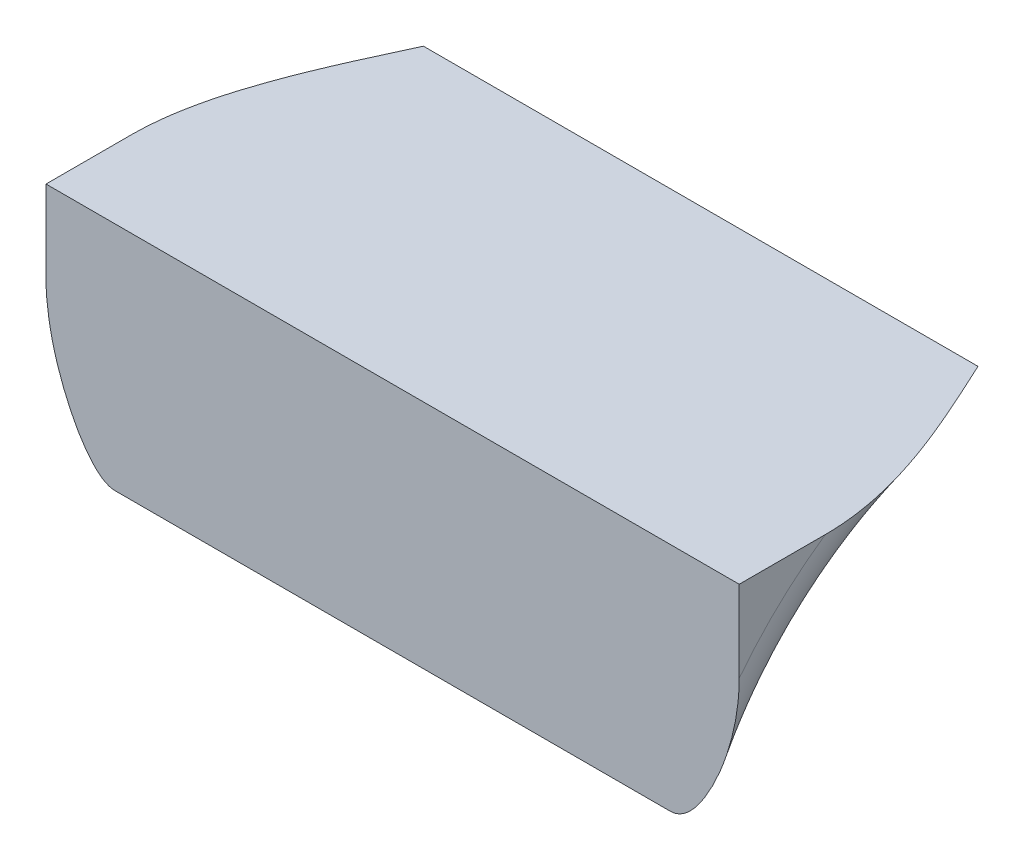
ISO-10303-21;
HEADER;
FILE_DESCRIPTION(('STEP AP214'),'2;1');
FILE_NAME('part.step','',(''),(''),'','','');
FILE_SCHEMA(('AUTOMOTIVE_DESIGN { 1 0 10303 214 1 1 1 1 }'));
ENDSEC;
DATA;
#1=APPLICATION_CONTEXT('core data for automotive mechanical design processes');
#2=APPLICATION_PROTOCOL_DEFINITION('international standard','automotive_design',2000,#1);
#3=PRODUCT_CONTEXT('',#1,'mechanical');
#4=PRODUCT('Part','Part','',(#3));
#5=PRODUCT_RELATED_PRODUCT_CATEGORY('part','',(#4));
#6=PRODUCT_DEFINITION_FORMATION('','',#4);
#7=PRODUCT_DEFINITION_CONTEXT('part definition',#1,'design');
#8=PRODUCT_DEFINITION('design','',#6,#7);
#9=PRODUCT_DEFINITION_SHAPE('','',#8);
#10=(LENGTH_UNIT() NAMED_UNIT(*) SI_UNIT(.MILLI.,.METRE.));
#11=(NAMED_UNIT(*) PLANE_ANGLE_UNIT() SI_UNIT($,.RADIAN.));
#12=(NAMED_UNIT(*) SI_UNIT($,.STERADIAN.) SOLID_ANGLE_UNIT());
#13=UNCERTAINTY_MEASURE_WITH_UNIT(LENGTH_MEASURE(1.E-05),#10,'distance_accuracy_value','');
#14=(GEOMETRIC_REPRESENTATION_CONTEXT(3) GLOBAL_UNCERTAINTY_ASSIGNED_CONTEXT((#13)) GLOBAL_UNIT_ASSIGNED_CONTEXT((#10,
#11,#12)) REPRESENTATION_CONTEXT('',''));
#15=CARTESIAN_POINT('',(0.,0.,0.));
#16=DIRECTION('',(0.,0.,1.));
#17=DIRECTION('',(1.,0.,0.));
#18=AXIS2_PLACEMENT_3D('',#15,#16,#17);
#19=CARTESIAN_POINT('',(5.34,-0.0166666666666927,-7.4));
#20=DIRECTION('',(-1.,0.,0.));
#21=DIRECTION('',(0.,0.,1.));
#22=AXIS2_PLACEMENT_3D('',#19,#20,#21);
#23=TOROIDAL_SURFACE('',#22,0.506666666666995,0.0899999999999993);
#24=CARTESIAN_POINT('',(5.34,-0.0166666666667221,-7.40000000000002));
#25=DIRECTION('',(-1.,0.,0.));
#26=DIRECTION('',(0.,0.,1.));
#27=AXIS2_PLACEMENT_3D('',#24,#25,#26);
#28=CIRCLE('',#27,0.416666666667021);
#29=CARTESIAN_POINT('',(5.34,0.10000000000003,-6.99999999999984));
#30=VERTEX_POINT('',#29);
#31=CARTESIAN_POINT('',(5.34,0.40000000000015,-7.4));
#32=VERTEX_POINT('',#31);
#33=EDGE_CURVE('E73',#30,#32,#28,.T.);
#34=ORIENTED_EDGE('',*,*,#33,.F.);
#35=CARTESIAN_POINT('',(5.25,0.29431743439214,-7.));
#36=CARTESIAN_POINT('',(5.25000257689525,0.28678338106452,-7.));
#37=CARTESIAN_POINT('',(5.25035567443866,0.279258916889631,-7.));
#38=CARTESIAN_POINT('',(5.25168700961234,0.264272874659193,-7.));
#39=CARTESIAN_POINT('',(5.25266455596784,0.256811236297325,-7.));
#40=CARTESIAN_POINT('',(5.25645142527365,0.234384133764241,-7.));
#41=CARTESIAN_POINT('',(5.26011148185746,0.219557655967787,-7.));
#42=CARTESIAN_POINT('',(5.26872439377415,0.19245860087185,-7.));
#43=CARTESIAN_POINT('',(5.27344165067632,0.180107956902744,-7.));
#44=CARTESIAN_POINT('',(5.28429411076941,0.156106187281331,-7.));
#45=CARTESIAN_POINT('',(5.29042016907056,0.144451135807996,-7.));
#46=CARTESIAN_POINT('',(5.30139175619852,0.127808975217373,-7.));
#47=CARTESIAN_POINT('',(5.30542956548305,0.122317350027401,-7.));
#48=CARTESIAN_POINT('',(5.31226356939469,0.114702664993153,-7.));
#49=CARTESIAN_POINT('',(5.31468981703352,0.112254142604962,-7.));
#50=CARTESIAN_POINT('',(5.31989362601097,0.107759627038366,-7.));
#51=CARTESIAN_POINT('',(5.32266929637702,0.105711608382615,-7.));
#52=CARTESIAN_POINT('',(5.32711460086318,0.103229870103113,-7.));
#53=CARTESIAN_POINT('',(5.32862028994545,0.102507233993482,-7.));
#54=CARTESIAN_POINT('',(5.33172418480276,0.101308280914606,-7.));
#55=CARTESIAN_POINT('',(5.33332199935786,0.100830996992606,-7.));
#56=CARTESIAN_POINT('',(5.33577880463312,0.100339629092012,-7.));
#57=CARTESIAN_POINT('',(5.33661601690168,0.100213173945489,-7.));
#58=CARTESIAN_POINT('',(5.3383019081971,0.100042972537691,-7.));
#59=CARTESIAN_POINT('',(5.33915061835458,0.099999536662611,-7.));
#60=CARTESIAN_POINT('',(5.34000000000035,0.100000000002899,-7.));
#61=B_SPLINE_CURVE_WITH_KNOTS('',3,(#35,#36,#37,#38,#39,#40,#41,#42,#43,#44,#45,#46,#47,#48,#49,
#50,#51,#52,#53,#54,#55,#56,#57,#58,#59,#60),.UNSPECIFIED.,.F.,.F.,(4,2,2,2,2,2,2,2,2,2,2,2,4),
(0.,0.0225788096461363,0.0451326674055985,0.0907782215687072,0.130374817366258,
0.169721295314198,0.19008827818017,0.200409303674087,0.210676699975487,0.215671790378637,
0.220647040822455,0.22318341517181,0.225729253917657),.UNSPECIFIED.);
#62=CARTESIAN_POINT('',(5.25,0.294317434392195,-7.));
#63=VERTEX_POINT('',#62);
#64=EDGE_CURVE('E68',#63,#30,#61,.T.);
#65=ORIENTED_EDGE('',*,*,#64,.F.);
#66=CARTESIAN_POINT('',(5.25,-0.0166666666666927,-7.4));
#67=DIRECTION('',(-1.,0.,0.));
#68=DIRECTION('',(0.,0.,1.));
#69=AXIS2_PLACEMENT_3D('',#66,#67,#68);
#70=CIRCLE('',#69,0.506666666666991);
#71=CARTESIAN_POINT('',(5.25,0.4,-7.11172929389074));
#72=VERTEX_POINT('',#71);
#73=EDGE_CURVE('E21',#72,#63,#70,.F.);
#74=ORIENTED_EDGE('',*,*,#73,.F.);
#75=CARTESIAN_POINT('',(5.34,0.400000000000152,-7.4));
#76=CARTESIAN_POINT('',(5.3394264635353,0.400000000000097,-7.39876593194068));
#77=CARTESIAN_POINT('',(5.33885292373588,0.400000000000047,-7.39753187207807));
#78=CARTESIAN_POINT('',(5.32561245318219,0.399999999998967,-7.36903846077597));
#79=CARTESIAN_POINT('',(5.31298285975115,0.399999999999728,-7.34176487111438));
#80=CARTESIAN_POINT('',(5.2895306975533,0.400000000000272,-7.28639982309714));
#81=CARTESIAN_POINT('',(5.27870698290532,0.400000000000054,-7.25830889675784));
#82=CARTESIAN_POINT('',(5.26489408361845,0.399999999999969,-7.21303952048627));
#83=CARTESIAN_POINT('',(5.26052997024305,0.399999999999992,-7.19629446422212));
#84=CARTESIAN_POINT('',(5.25378981108278,0.400000000000008,-7.16238876865434));
#85=CARTESIAN_POINT('',(5.25141174148565,0.400000000000002,-7.14522857078599));
#86=CARTESIAN_POINT('',(5.2498281432553,0.399999999999999,-7.11659396280128));
#87=CARTESIAN_POINT('',(5.24981959727615,0.4,-7.10516725656242));
#88=CARTESIAN_POINT('',(5.25139009883906,0.4,-7.0824144027815));
#89=CARTESIAN_POINT('',(5.25296658349862,0.4,-7.07108812268302));
#90=CARTESIAN_POINT('',(5.25725870229677,0.4,-7.05266875179284));
#91=CARTESIAN_POINT('',(5.25940558470931,0.4,-7.0454444396699));
#92=CARTESIAN_POINT('',(5.26473137562286,0.4,-7.03138042185793));
#93=CARTESIAN_POINT('',(5.26790890880121,0.4,-7.02454021779805));
#94=CARTESIAN_POINT('',(5.27443884956401,0.4,-7.01326965039486));
#95=CARTESIAN_POINT('',(5.27751935045147,0.4,-7.00868262471168));
#96=CARTESIAN_POINT('',(5.28436041779118,0.4,-7.00004403667216));
#97=CARTESIAN_POINT('',(5.28811998896204,0.4,-6.99599170548487));
#98=CARTESIAN_POINT('',(5.29543188886495,0.4,-6.98944200302973));
#99=CARTESIAN_POINT('',(5.29885228428787,0.4,-6.9867980071836));
#100=CARTESIAN_POINT('',(5.30608102890694,0.4,-6.98210160120376));
#101=CARTESIAN_POINT('',(5.3098891862173,0.4,-6.98004890037208));
#102=CARTESIAN_POINT('',(5.31785061443701,0.4,-6.97665091304317));
#103=CARTESIAN_POINT('',(5.32200646589342,0.4,-6.97531158287709));
#104=CARTESIAN_POINT('',(5.33050109227432,0.4,-6.9734751714876));
#105=CARTESIAN_POINT('',(5.33483973726038,0.4,-6.97297750198901));
#106=CARTESIAN_POINT('',(5.34294181761328,0.4,-6.97287406118691));
#107=CARTESIAN_POINT('',(5.34670423222505,0.4,-6.97315746171378));
#108=CARTESIAN_POINT('',(5.35412119918076,0.4,-6.97436584450932));
#109=CARTESIAN_POINT('',(5.35777582473137,0.4,-6.97529038036805));
#110=CARTESIAN_POINT('',(5.36481422020849,0.4,-6.97769876130399));
#111=CARTESIAN_POINT('',(5.36820185844863,0.4,-6.97917145764801));
#112=CARTESIAN_POINT('',(5.37472828980895,0.4,-6.98260485602442));
#113=CARTESIAN_POINT('',(5.37786642500256,0.4,-6.98456679532048));
#114=CARTESIAN_POINT('',(5.38507271381958,0.4,-6.9897808110808));
#115=CARTESIAN_POINT('',(5.38899555576081,0.4,-6.99323221615451));
#116=CARTESIAN_POINT('',(5.39620981145504,0.4,-7.00070636123279));
#117=CARTESIAN_POINT('',(5.39950481977874,0.4,-7.00472560425642));
#118=CARTESIAN_POINT('',(5.40248619789847,0.4,-7.00893530556599));
#119=B_SPLINE_CURVE_WITH_KNOTS('',3,(#75,#76,#77,#78,#79,#80,#81,#82,#83,#84,#85,#86,#87,#88,
#89,#90,#91,#92,#93,#94,#95,#96,#97,#98,#99,#100,#101,#102,#103,#104,#105,#106,#107,#108,#109,
#110,#111,#112,#113,#114,#115,#116,#117,#118),.UNSPECIFIED.,.F.,.F.,(4,2,2,2,2,2,2,2,2,2,2,2,2,
2,2,2,2,2,2,2,2,4),(0.,0.00408248290555954,0.0942588862587985,0.184377850709854,
0.236215222395578,0.287999706244645,0.322202141648604,0.356349362928938,0.378898897846317,
0.401418465125346,0.417941063378824,0.434439638888985,0.447359524167644,0.460273046768718,
0.473292765352611,0.486303380092392,0.497566283987445,0.508821353607183,0.519859017186271,
0.530924882523037,0.546521676894589,0.562026298275779),.UNSPECIFIED.);
#120=EDGE_CURVE('E65',#32,#72,#119,.T.);
#121=ORIENTED_EDGE('',*,*,#120,.F.);
#122=EDGE_LOOP('',(#34,#65,#74,#121));
#123=FACE_BOUND('',#122,.T.);
#124=ADVANCED_FACE('F17',(#123),#23,.T.);
#125=CARTESIAN_POINT('',(6.06,-0.0166666666667221,-7.40000000000002));
#126=DIRECTION('',(-1.,0.,0.));
#127=DIRECTION('',(0.,-1.,0.));
#128=AXIS2_PLACEMENT_3D('',#125,#126,#127);
#129=CYLINDRICAL_SURFACE('',#128,0.416666666667021);
#130=DIRECTION('',(1.,0.,0.));
#131=VECTOR('',#130,1.);
#132=CARTESIAN_POINT('',(5.7,0.1,-7.));
#133=LINE('',#132,#131);
#134=CARTESIAN_POINT('',(6.06,0.100000000000581,-7.));
#135=VERTEX_POINT('',#134);
#136=EDGE_CURVE('E84',#30,#135,#133,.T.);
#137=ORIENTED_EDGE('',*,*,#136,.F.);
#138=ORIENTED_EDGE('',*,*,#33,.T.);
#139=DIRECTION('',(-1.,0.,0.));
#140=VECTOR('',#139,1.);
#141=CARTESIAN_POINT('',(5.70000000000013,0.4,-7.4));
#142=LINE('',#141,#140);
#143=CARTESIAN_POINT('',(6.06,0.40000000000015,-7.4));
#144=VERTEX_POINT('',#143);
#145=EDGE_CURVE('E82',#144,#32,#142,.T.);
#146=ORIENTED_EDGE('',*,*,#145,.F.);
#147=CARTESIAN_POINT('',(6.06,-0.0166666666667035,-7.4));
#148=DIRECTION('',(-1.,0.,0.));
#149=DIRECTION('',(0.,-1.,0.));
#150=AXIS2_PLACEMENT_3D('',#147,#148,#149);
#151=CIRCLE('',#150,0.416666666667001);
#152=EDGE_CURVE('E72',#135,#144,#151,.T.);
#153=ORIENTED_EDGE('',*,*,#152,.F.);
#154=EDGE_LOOP('',(#137,#138,#146,#153));
#155=FACE_BOUND('',#154,.T.);
#156=ADVANCED_FACE('F104',(#155),#129,.F.);
#157=CARTESIAN_POINT('',(5.25,0.293317434392,-7.11272929389048));
#158=DIRECTION('',(-1.,0.,0.));
#159=DIRECTION('',(0.,0.,1.));
#160=AXIS2_PLACEMENT_3D('',#157,#158,#159);
#161=PLANE('',#160);
#162=DIRECTION('',(0.,-1.,0.));
#163=VECTOR('',#162,1.);
#164=CARTESIAN_POINT('',(5.25,0.25,-7.));
#165=LINE('',#164,#163);
#166=CARTESIAN_POINT('',(5.25,0.4,-7.));
#167=VERTEX_POINT('',#166);
#168=EDGE_CURVE('E76',#167,#63,#165,.T.);
#169=ORIENTED_EDGE('',*,*,#168,.F.);
#170=DIRECTION('',(0.,0.,1.));
#171=VECTOR('',#170,1.);
#172=CARTESIAN_POINT('',(5.25,0.4,-7.2));
#173=LINE('',#172,#171);
#174=EDGE_CURVE('E74',#72,#167,#173,.T.);
#175=ORIENTED_EDGE('',*,*,#174,.F.);
#176=ORIENTED_EDGE('',*,*,#73,.T.);
#177=EDGE_LOOP('',(#169,#175,#176));
#178=FACE_BOUND('',#177,.T.);
#179=ADVANCED_FACE('F75',(#178),#161,.T.);
#180=CARTESIAN_POINT('',(6.06,-0.0166666666667035,-7.4));
#181=DIRECTION('',(1.,0.,0.));
#182=DIRECTION('',(0.,1.,0.));
#183=AXIS2_PLACEMENT_3D('',#180,#181,#182);
#184=TOROIDAL_SURFACE('',#183,0.506666666667001,0.0899999999999988);
#185=CARTESIAN_POINT('',(6.15,-0.0166666666667032,-7.4));
#186=DIRECTION('',(1.,0.,0.));
#187=DIRECTION('',(0.,1.,0.));
#188=AXIS2_PLACEMENT_3D('',#185,#186,#187);
#189=CIRCLE('',#188,0.506666666667);
#190=CARTESIAN_POINT('',(6.15,0.294317434392177,-6.99999999999994));
#191=VERTEX_POINT('',#190);
#192=CARTESIAN_POINT('',(6.15,0.4,-7.11172929389113));
#193=VERTEX_POINT('',#192);
#194=EDGE_CURVE('E121',#191,#193,#189,.F.);
#195=ORIENTED_EDGE('',*,*,#194,.F.);
#196=CARTESIAN_POINT('',(6.06,0.100000000001161,-7.));
#197=CARTESIAN_POINT('',(6.06179744020447,0.0999924228705031,-7.));
#198=CARTESIAN_POINT('',(6.06358197983579,0.100192013682649,-7.));
#199=CARTESIAN_POINT('',(6.06704597855897,0.100927010427306,-7.));
#200=CARTESIAN_POINT('',(6.06872681056904,0.101455768565924,-7.));
#201=CARTESIAN_POINT('',(6.07248809473559,0.102983076690191,-7.));
#202=CARTESIAN_POINT('',(6.07452839958886,0.104076987852529,-7.));
#203=CARTESIAN_POINT('',(6.07843047637996,0.106568552236213,-7.));
#204=CARTESIAN_POINT('',(6.08029050638506,0.107968810698181,-7.));
#205=CARTESIAN_POINT('',(6.08656410542717,0.113235905923519,-7.));
#206=CARTESIAN_POINT('',(6.09054368091173,0.117606405467007,-7.));
#207=CARTESIAN_POINT('',(6.0978895207235,0.126826252493663,-7.));
#208=CARTESIAN_POINT('',(6.10125222596013,0.131678144302158,-7.));
#209=CARTESIAN_POINT('',(6.1088269994572,0.143676206869678,-7.));
#210=CARTESIAN_POINT('',(6.11283059244185,0.150954943579548,-7.));
#211=CARTESIAN_POINT('',(6.12021324720343,0.165825412207008,-7.));
#212=CARTESIAN_POINT('',(6.12359118122704,0.173417679723142,-7.));
#213=CARTESIAN_POINT('',(6.13286895184523,0.19649886587486,-7.));
#214=CARTESIAN_POINT('',(6.1379375437972,0.212334771902861,-7.));
#215=CARTESIAN_POINT('',(6.14438694776931,0.239256380490723,-7.));
#216=CARTESIAN_POINT('',(6.14643271300567,0.250185859063881,-7.));
#217=CARTESIAN_POINT('',(6.14923061064082,0.272172051926927,-7.));
#218=CARTESIAN_POINT('',(6.14998661136521,0.283228285265503,-7.));
#219=CARTESIAN_POINT('',(6.15,0.29431743439214,-7.));
#220=B_SPLINE_CURVE_WITH_KNOTS('',3,(#196,#197,#198,#199,#200,#201,#202,#203,#204,#205,#206,
#207,#208,#209,#210,#211,#212,#213,#214,#215,#216,#217,#218,#219),.UNSPECIFIED.,.F.,.F.,(4,2,2,
2,2,2,2,2,2,2,2,4),(0.,0.00536075382320548,0.010616606247539,0.0175220325716479,
0.0244886399425507,0.0420846993037865,0.0597792898738605,0.0846486742987684,0.109562458701926,
0.159243487630327,0.192536219053162,0.225728920570021),.UNSPECIFIED.);
#221=EDGE_CURVE('E115',#135,#191,#220,.T.);
#222=ORIENTED_EDGE('',*,*,#221,.F.);
#223=ORIENTED_EDGE('',*,*,#152,.T.);
#224=CARTESIAN_POINT('',(6.15,0.4,-7.11172929389078));
#225=CARTESIAN_POINT('',(6.14999182842346,0.399999999999996,-7.12226420753039));
#226=CARTESIAN_POINT('',(6.1494028243284,0.399999999999998,-7.13277700198317));
#227=CARTESIAN_POINT('',(6.14726599110171,0.400000000000002,-7.15367604203973));
#228=CARTESIAN_POINT('',(6.14572102174286,0.400000000000004,-7.16406257121817));
#229=CARTESIAN_POINT('',(6.13999308605275,0.399999999999992,-7.1947648430101));
#230=CARTESIAN_POINT('',(6.13470744786309,0.399999999999959,-7.21486900488506));
#231=CARTESIAN_POINT('',(6.11974800521697,0.400000000000058,-7.26244598701135));
#232=CARTESIAN_POINT('',(6.10916406862755,0.400000000000261,-7.28961338382096));
#233=CARTESIAN_POINT('',(6.08630890933996,0.399999999999738,-7.34329374444186));
#234=CARTESIAN_POINT('',(6.07403179493464,0.399999999999008,-7.36980402410914));
#235=CARTESIAN_POINT('',(6.06114707388985,0.400000000000046,-7.39753187909951));
#236=CARTESIAN_POINT('',(6.06057353380748,0.400000000000096,-7.39876593921818));
#237=CARTESIAN_POINT('',(6.06,0.40000000000015,-7.4));
#238=B_SPLINE_CURVE_WITH_KNOTS('',3,(#224,#225,#226,#227,#228,#229,#230,#231,#232,#233,#234,
#235,#236,#237),.UNSPECIFIED.,.F.,.F.,(4,2,2,2,2,2,4),(0.,0.0315568765275959,0.0630198039516715,
0.125216483284959,0.212547910911541,0.300191273586474,0.304273756562109),.UNSPECIFIED.);
#239=EDGE_CURVE('E77',#193,#144,#238,.T.);
#240=ORIENTED_EDGE('',*,*,#239,.F.);
#241=EDGE_LOOP('',(#195,#222,#223,#240));
#242=FACE_BOUND('',#241,.T.);
#243=ADVANCED_FACE('F110',(#242),#184,.T.);
#244=CARTESIAN_POINT('',(5.24899999999974,0.4,-6.999));
#245=DIRECTION('',(0.,1.,0.));
#246=DIRECTION('',(1.,0.,0.));
#247=AXIS2_PLACEMENT_3D('',#244,#245,#246);
#248=PLANE('',#247);
#249=ORIENTED_EDGE('',*,*,#145,.T.);
#250=ORIENTED_EDGE('',*,*,#120,.T.);
#251=ORIENTED_EDGE('',*,*,#174,.T.);
#252=DIRECTION('',(-1.,0.,0.));
#253=VECTOR('',#252,1.);
#254=CARTESIAN_POINT('',(5.7,0.4,-7.));
#255=LINE('',#254,#253);
#256=CARTESIAN_POINT('',(6.15,0.4,-7.));
#257=VERTEX_POINT('',#256);
#258=EDGE_CURVE('E36',#257,#167,#255,.T.);
#259=ORIENTED_EDGE('',*,*,#258,.F.);
#260=DIRECTION('',(0.,0.,1.));
#261=VECTOR('',#260,1.);
#262=CARTESIAN_POINT('',(6.15,0.4,-7.05586464694518));
#263=LINE('',#262,#261);
#264=EDGE_CURVE('E27',#193,#257,#263,.T.);
#265=ORIENTED_EDGE('',*,*,#264,.F.);
#266=ORIENTED_EDGE('',*,*,#239,.T.);
#267=EDGE_LOOP('',(#249,#250,#251,#259,#265,#266));
#268=FACE_BOUND('',#267,.T.);
#269=ADVANCED_FACE('F79',(#268),#248,.T.);
#270=CARTESIAN_POINT('',(5.249,0.0990000000000002,-7.));
#271=DIRECTION('',(0.,0.,1.));
#272=DIRECTION('',(1.,0.,0.));
#273=AXIS2_PLACEMENT_3D('',#270,#271,#272);
#274=PLANE('',#273);
#275=ORIENTED_EDGE('',*,*,#258,.T.);
#276=ORIENTED_EDGE('',*,*,#168,.T.);
#277=ORIENTED_EDGE('',*,*,#64,.T.);
#278=ORIENTED_EDGE('',*,*,#136,.T.);
#279=ORIENTED_EDGE('',*,*,#221,.T.);
#280=DIRECTION('',(0.,-1.,0.));
#281=VECTOR('',#280,1.);
#282=CARTESIAN_POINT('',(6.15,0.347158717196,-7.));
#283=LINE('',#282,#281);
#284=EDGE_CURVE('E11',#257,#191,#283,.T.);
#285=ORIENTED_EDGE('',*,*,#284,.F.);
#286=EDGE_LOOP('',(#275,#276,#277,#278,#279,#285));
#287=FACE_BOUND('',#286,.T.);
#288=ADVANCED_FACE('F123',(#287),#274,.T.);
#289=CARTESIAN_POINT('',(6.15,0.293317434392,-6.99899999999988));
#290=DIRECTION('',(1.,0.,0.));
#291=DIRECTION('',(0.,0.,-1.));
#292=AXIS2_PLACEMENT_3D('',#289,#290,#291);
#293=PLANE('',#292);
#294=ORIENTED_EDGE('',*,*,#264,.T.);
#295=ORIENTED_EDGE('',*,*,#284,.T.);
#296=ORIENTED_EDGE('',*,*,#194,.T.);
#297=EDGE_LOOP('',(#294,#295,#296));
#298=FACE_BOUND('',#297,.T.);
#299=ADVANCED_FACE('F19',(#298),#293,.T.);
#300=CLOSED_SHELL('',(#124,#156,#179,#243,#269,#288,#299));
#301=MANIFOLD_SOLID_BREP('B1',#300);
#302=ADVANCED_BREP_SHAPE_REPRESENTATION('',(#18,#301),#14);
#303=SHAPE_DEFINITION_REPRESENTATION(#9,#302);
ENDSEC;
END-ISO-10303-21;
